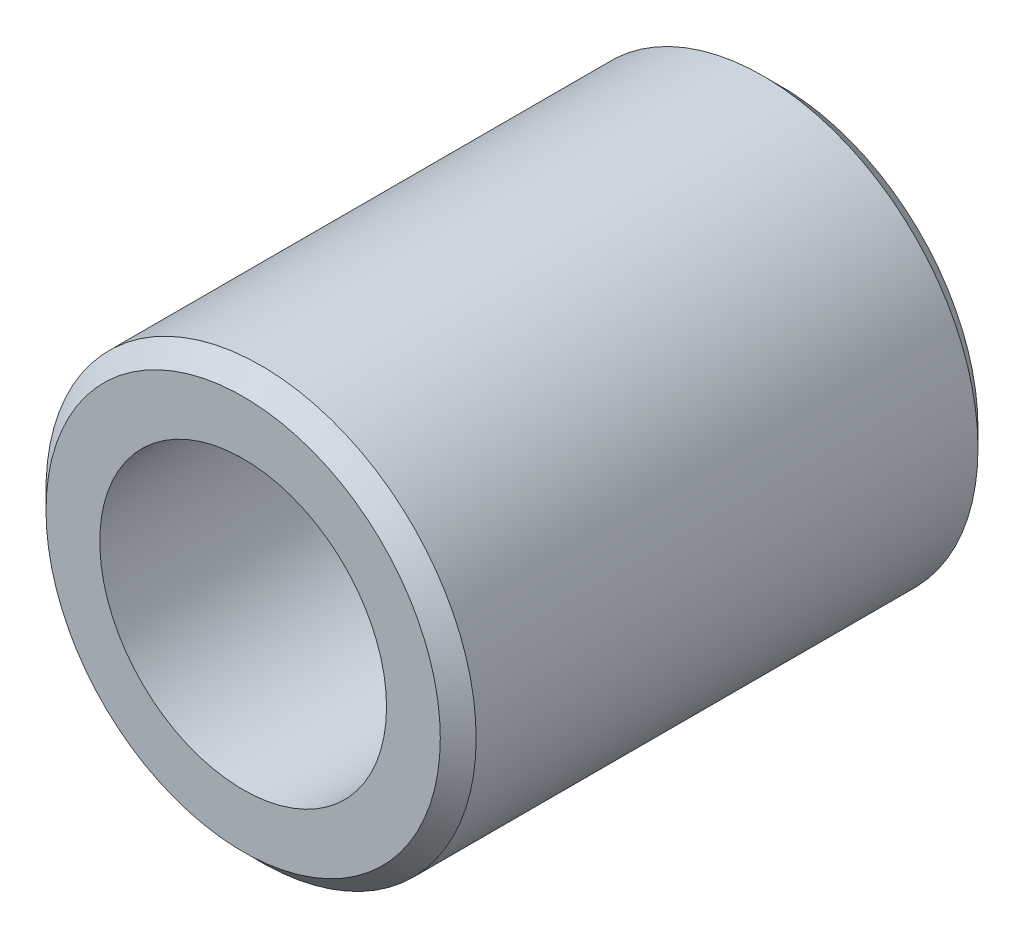
ISO-10303-21;
HEADER;
FILE_DESCRIPTION(('STEP AP214'),'2;1');
FILE_NAME('part.step','',(''),(''),'','','');
FILE_SCHEMA(('AUTOMOTIVE_DESIGN { 1 0 10303 214 1 1 1 1 }'));
ENDSEC;
DATA;
#1=APPLICATION_CONTEXT('core data for automotive mechanical design processes');
#2=APPLICATION_PROTOCOL_DEFINITION('international standard','automotive_design',2000,#1);
#3=PRODUCT_CONTEXT('',#1,'mechanical');
#4=PRODUCT('Part','Part','',(#3));
#5=PRODUCT_RELATED_PRODUCT_CATEGORY('part','',(#4));
#6=PRODUCT_DEFINITION_FORMATION('','',#4);
#7=PRODUCT_DEFINITION_CONTEXT('part definition',#1,'design');
#8=PRODUCT_DEFINITION('design','',#6,#7);
#9=PRODUCT_DEFINITION_SHAPE('','',#8);
#10=(LENGTH_UNIT() NAMED_UNIT(*) SI_UNIT(.MILLI.,.METRE.));
#11=(NAMED_UNIT(*) PLANE_ANGLE_UNIT() SI_UNIT($,.RADIAN.));
#12=(NAMED_UNIT(*) SI_UNIT($,.STERADIAN.) SOLID_ANGLE_UNIT());
#13=UNCERTAINTY_MEASURE_WITH_UNIT(LENGTH_MEASURE(1.E-05),#10,'distance_accuracy_value','');
#14=(GEOMETRIC_REPRESENTATION_CONTEXT(3) GLOBAL_UNCERTAINTY_ASSIGNED_CONTEXT((#13)) GLOBAL_UNIT_ASSIGNED_CONTEXT((#10,
#11,#12)) REPRESENTATION_CONTEXT('',''));
#15=CARTESIAN_POINT('',(0.,0.,0.));
#16=DIRECTION('',(0.,0.,1.));
#17=DIRECTION('',(1.,0.,0.));
#18=AXIS2_PLACEMENT_3D('',#15,#16,#17);
#19=CARTESIAN_POINT('',(0.,0.,15.));
#20=DIRECTION('',(0.,0.,1.));
#21=DIRECTION('',(1.,0.,0.));
#22=AXIS2_PLACEMENT_3D('',#19,#20,#21);
#23=PLANE('',#22);
#24=CARTESIAN_POINT('',(0.,0.,15.));
#25=DIRECTION('',(0.,0.,1.));
#26=DIRECTION('',(1.,0.,0.));
#27=AXIS2_PLACEMENT_3D('',#24,#25,#26);
#28=CIRCLE('',#27,5.5);
#29=CARTESIAN_POINT('',(5.5,0.,15.));
#30=VERTEX_POINT('',#29);
#31=EDGE_CURVE('E11',#30,#30,#28,.T.);
#32=ORIENTED_EDGE('',*,*,#31,.T.);
#33=EDGE_LOOP('',(#32));
#34=FACE_BOUND('',#33,.T.);
#35=CARTESIAN_POINT('',(0.,0.,15.));
#36=DIRECTION('',(0.,0.,1.));
#37=DIRECTION('',(1.,0.,0.));
#38=AXIS2_PLACEMENT_3D('',#35,#36,#37);
#39=CIRCLE('',#38,4.);
#40=CARTESIAN_POINT('',(4.,0.,15.));
#41=VERTEX_POINT('',#40);
#42=EDGE_CURVE('E57',#41,#41,#39,.T.);
#43=ORIENTED_EDGE('',*,*,#42,.F.);
#44=EDGE_LOOP('',(#43));
#45=FACE_BOUND('',#44,.T.);
#46=ADVANCED_FACE('F37',(#34,#45),#23,.T.);
#47=CARTESIAN_POINT('',(0.,0.,0.));
#48=DIRECTION('',(0.,0.,1.));
#49=DIRECTION('',(1.,0.,0.));
#50=AXIS2_PLACEMENT_3D('',#47,#48,#49);
#51=PLANE('',#50);
#52=CARTESIAN_POINT('',(0.,0.,0.));
#53=DIRECTION('',(0.,0.,1.));
#54=DIRECTION('',(1.,0.,0.));
#55=AXIS2_PLACEMENT_3D('',#52,#53,#54);
#56=CIRCLE('',#55,5.49999999999999);
#57=CARTESIAN_POINT('',(5.49999999999999,0.,0.));
#58=VERTEX_POINT('',#57);
#59=EDGE_CURVE('E44',#58,#58,#56,.F.);
#60=ORIENTED_EDGE('',*,*,#59,.T.);
#61=EDGE_LOOP('',(#60));
#62=FACE_BOUND('',#61,.T.);
#63=CARTESIAN_POINT('',(0.,0.,0.));
#64=DIRECTION('',(0.,0.,1.));
#65=DIRECTION('',(1.,0.,0.));
#66=AXIS2_PLACEMENT_3D('',#63,#64,#65);
#67=CIRCLE('',#66,4.);
#68=CARTESIAN_POINT('',(4.,0.,0.));
#69=VERTEX_POINT('',#68);
#70=EDGE_CURVE('E58',#69,#69,#67,.T.);
#71=ORIENTED_EDGE('',*,*,#70,.T.);
#72=EDGE_LOOP('',(#71));
#73=FACE_BOUND('',#72,.T.);
#74=ADVANCED_FACE('F68',(#62,#73),#51,.F.);
#75=CARTESIAN_POINT('',(0.,0.,15.));
#76=DIRECTION('',(0.,0.,-1.));
#77=DIRECTION('',(-1.,0.,0.));
#78=AXIS2_PLACEMENT_3D('',#75,#76,#77);
#79=CYLINDRICAL_SURFACE('',#78,6.);
#80=CARTESIAN_POINT('',(0.,0.,0.500000000000007));
#81=DIRECTION('',(0.,0.,1.));
#82=DIRECTION('',(1.,0.,0.));
#83=AXIS2_PLACEMENT_3D('',#80,#81,#82);
#84=CIRCLE('',#83,6.);
#85=CARTESIAN_POINT('',(6.,0.,0.500000000000007));
#86=VERTEX_POINT('',#85);
#87=EDGE_CURVE('E48',#86,#86,#84,.T.);
#88=ORIENTED_EDGE('',*,*,#87,.T.);
#89=EDGE_LOOP('',(#88));
#90=FACE_BOUND('',#89,.T.);
#91=CARTESIAN_POINT('',(0.,0.,14.5));
#92=DIRECTION('',(0.,0.,1.));
#93=DIRECTION('',(1.,0.,0.));
#94=AXIS2_PLACEMENT_3D('',#91,#92,#93);
#95=CIRCLE('',#94,6.);
#96=CARTESIAN_POINT('',(6.,0.,14.5));
#97=VERTEX_POINT('',#96);
#98=EDGE_CURVE('E52',#97,#97,#95,.F.);
#99=ORIENTED_EDGE('',*,*,#98,.T.);
#100=EDGE_LOOP('',(#99));
#101=FACE_BOUND('',#100,.T.);
#102=ADVANCED_FACE('F73',(#90,#101),#79,.T.);
#103=CARTESIAN_POINT('',(0.,0.,15.));
#104=DIRECTION('',(0.,0.,-1.));
#105=DIRECTION('',(-1.,0.,0.));
#106=AXIS2_PLACEMENT_3D('',#103,#104,#105);
#107=CYLINDRICAL_SURFACE('',#106,4.);
#108=ORIENTED_EDGE('',*,*,#42,.T.);
#109=EDGE_LOOP('',(#108));
#110=FACE_BOUND('',#109,.T.);
#111=ORIENTED_EDGE('',*,*,#70,.F.);
#112=EDGE_LOOP('',(#111));
#113=FACE_BOUND('',#112,.T.);
#114=ADVANCED_FACE('F64',(#110,#113),#107,.F.);
#115=CARTESIAN_POINT('',(0.,0.,0.500000000000007));
#116=DIRECTION('',(0.,0.,1.));
#117=DIRECTION('',(1.,0.,0.));
#118=AXIS2_PLACEMENT_3D('',#115,#116,#117);
#119=CONICAL_SURFACE('',#118,6.,0.785398163397448);
#120=ORIENTED_EDGE('',*,*,#59,.F.);
#121=EDGE_LOOP('',(#120));
#122=FACE_BOUND('',#121,.T.);
#123=ORIENTED_EDGE('',*,*,#87,.F.);
#124=EDGE_LOOP('',(#123));
#125=FACE_BOUND('',#124,.T.);
#126=ADVANCED_FACE('F79',(#122,#125),#119,.T.);
#127=CARTESIAN_POINT('',(0.,0.,15.));
#128=DIRECTION('',(0.,0.,-1.));
#129=DIRECTION('',(-1.,0.,0.));
#130=AXIS2_PLACEMENT_3D('',#127,#128,#129);
#131=CONICAL_SURFACE('',#130,5.5,0.785398163397444);
#132=ORIENTED_EDGE('',*,*,#98,.F.);
#133=EDGE_LOOP('',(#132));
#134=FACE_BOUND('',#133,.T.);
#135=ORIENTED_EDGE('',*,*,#31,.F.);
#136=EDGE_LOOP('',(#135));
#137=FACE_BOUND('',#136,.T.);
#138=ADVANCED_FACE('F39',(#134,#137),#131,.T.);
#139=CLOSED_SHELL('',(#46,#74,#102,#114,#126,#138));
#140=MANIFOLD_SOLID_BREP('B2',#139);
#141=ADVANCED_BREP_SHAPE_REPRESENTATION('',(#18,#140),#14);
#142=SHAPE_DEFINITION_REPRESENTATION(#9,#141);
ENDSEC;
END-ISO-10303-21;
